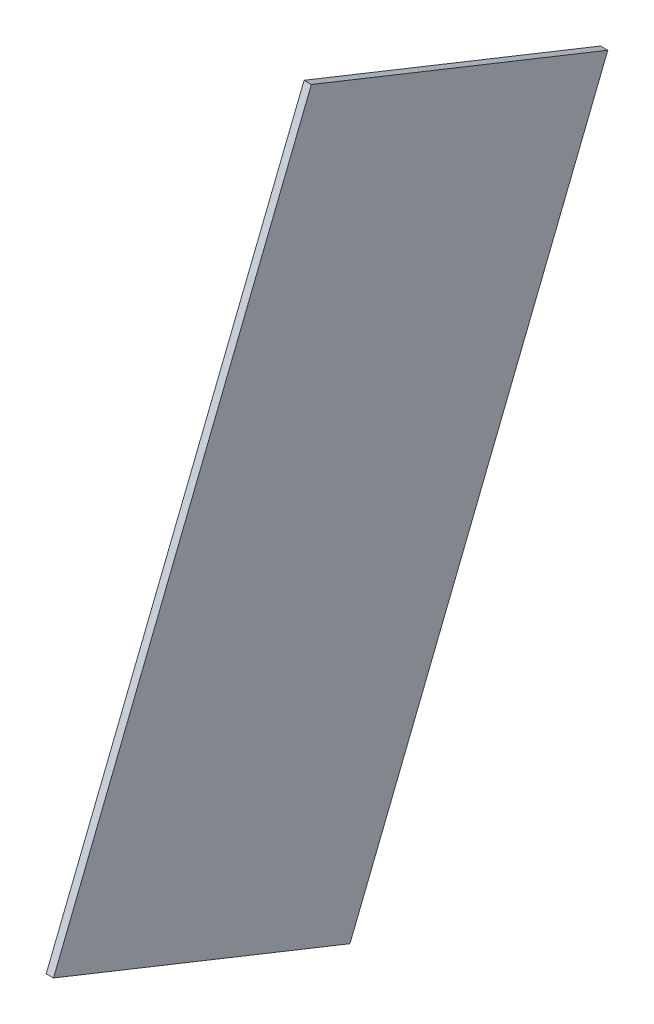
ISO-10303-21;
HEADER;
FILE_DESCRIPTION(('STEP AP214'),'2;1');
FILE_NAME('part.step','',(''),(''),'','','');
FILE_SCHEMA(('AUTOMOTIVE_DESIGN { 1 0 10303 214 1 1 1 1 }'));
ENDSEC;
DATA;
#1=APPLICATION_CONTEXT('core data for automotive mechanical design processes');
#2=APPLICATION_PROTOCOL_DEFINITION('international standard','automotive_design',2000,#1);
#3=PRODUCT_CONTEXT('',#1,'mechanical');
#4=PRODUCT('Part','Part','',(#3));
#5=PRODUCT_RELATED_PRODUCT_CATEGORY('part','',(#4));
#6=PRODUCT_DEFINITION_FORMATION('','',#4);
#7=PRODUCT_DEFINITION_CONTEXT('part definition',#1,'design');
#8=PRODUCT_DEFINITION('design','',#6,#7);
#9=PRODUCT_DEFINITION_SHAPE('','',#8);
#10=(LENGTH_UNIT() NAMED_UNIT(*) SI_UNIT(.MILLI.,.METRE.));
#11=(NAMED_UNIT(*) PLANE_ANGLE_UNIT() SI_UNIT($,.RADIAN.));
#12=(NAMED_UNIT(*) SI_UNIT($,.STERADIAN.) SOLID_ANGLE_UNIT());
#13=UNCERTAINTY_MEASURE_WITH_UNIT(LENGTH_MEASURE(1.E-05),#10,'distance_accuracy_value','');
#14=(GEOMETRIC_REPRESENTATION_CONTEXT(3) GLOBAL_UNCERTAINTY_ASSIGNED_CONTEXT((#13)) GLOBAL_UNIT_ASSIGNED_CONTEXT((#10,
#11,#12)) REPRESENTATION_CONTEXT('',''));
#15=CARTESIAN_POINT('',(0.,0.,0.));
#16=DIRECTION('',(0.,0.,1.));
#17=DIRECTION('',(1.,0.,0.));
#18=AXIS2_PLACEMENT_3D('',#15,#16,#17);
#19=CARTESIAN_POINT('',(0.835351593057334,-1012.80899751434,-1561.26799174818));
#20=DIRECTION('',(1.,0.,0.));
#21=DIRECTION('',(0.,1.,0.));
#22=AXIS2_PLACEMENT_3D('',#19,#20,#21);
#23=PLANE('',#22);
#24=DIRECTION('',(0.,-0.371270426393831,-0.928524781836943));
#25=VECTOR('',#24,1.);
#26=CARTESIAN_POINT('',(0.835351593057223,-891.14035938506,-1609.91716949834));
#27=LINE('',#26,#25);
#28=CARTESIAN_POINT('',(0.835351593056808,-842.503933527468,-1488.2804230777));
#29=VERTEX_POINT('',#28);
#30=CARTESIAN_POINT('',(0.835351593057223,-891.14035938506,-1609.91716949834));
#31=VERTEX_POINT('',#30);
#32=EDGE_CURVE('E83',#29,#31,#27,.T.);
#33=ORIENTED_EDGE('',*,*,#32,.F.);
#34=DIRECTION('',(0.,0.928524781836943,-0.371270426393831));
#35=VECTOR('',#34,1.);
#36=CARTESIAN_POINT('',(0.835351593057161,-964.172571656747,-1439.63124532754));
#37=LINE('',#36,#35);
#38=CARTESIAN_POINT('',(0.835351593056808,-577.874370703939,-1594.09249459994));
#39=VERTEX_POINT('',#38);
#40=EDGE_CURVE('E37',#29,#39,#37,.T.);
#41=ORIENTED_EDGE('',*,*,#40,.T.);
#42=DIRECTION('',(0.,-0.371270426393832,-0.928524781836943));
#43=VECTOR('',#42,1.);
#44=CARTESIAN_POINT('',(0.835351593056981,-626.510796561531,-1715.72924102059));
#45=LINE('',#44,#43);
#46=CARTESIAN_POINT('',(0.835351593056981,-626.510796561531,-1715.72924102059));
#47=VERTEX_POINT('',#46);
#48=EDGE_CURVE('E81',#39,#47,#45,.T.);
#49=ORIENTED_EDGE('',*,*,#48,.T.);
#50=DIRECTION('',(0.,0.928524781836943,-0.371270426393831));
#51=VECTOR('',#50,1.);
#52=CARTESIAN_POINT('',(0.835351593057334,-1012.80899751434,-1561.26799174818));
#53=LINE('',#52,#51);
#54=EDGE_CURVE('E72',#31,#47,#53,.T.);
#55=ORIENTED_EDGE('',*,*,#54,.F.);
#56=EDGE_LOOP('',(#33,#41,#49,#55));
#57=FACE_BOUND('',#56,.T.);
#58=ADVANCED_FACE('F33',(#57),#23,.F.);
#59=CARTESIAN_POINT('',(0.835351593057334,-1012.80899751434,-1561.26799174818));
#60=DIRECTION('',(0.,0.371270426393831,0.928524781836943));
#61=DIRECTION('',(0.,-0.928524781836943,0.371270426393831));
#62=AXIS2_PLACEMENT_3D('',#59,#60,#61);
#63=PLANE('',#62);
#64=DIRECTION('',(1.,0.,0.));
#65=VECTOR('',#64,1.);
#66=CARTESIAN_POINT('',(0.835351593057223,-891.14035938506,-1609.91716949834));
#67=LINE('',#66,#65);
#68=CARTESIAN_POINT('',(3.83535159305722,-891.14035938506,-1609.91716949834));
#69=VERTEX_POINT('',#68);
#70=EDGE_CURVE('E42',#31,#69,#67,.T.);
#71=ORIENTED_EDGE('',*,*,#70,.F.);
#72=ORIENTED_EDGE('',*,*,#54,.T.);
#73=DIRECTION('',(1.,0.,0.));
#74=VECTOR('',#73,1.);
#75=CARTESIAN_POINT('',(0.835351593056981,-626.510796561531,-1715.72924102059));
#76=LINE('',#75,#74);
#77=CARTESIAN_POINT('',(3.83535159305698,-626.510796561531,-1715.72924102059));
#78=VERTEX_POINT('',#77);
#79=EDGE_CURVE('E93',#47,#78,#76,.T.);
#80=ORIENTED_EDGE('',*,*,#79,.T.);
#81=DIRECTION('',(0.,0.928524781836943,-0.371270426393831));
#82=VECTOR('',#81,1.);
#83=CARTESIAN_POINT('',(3.83535159305733,-1012.80899751434,-1561.26799174818));
#84=LINE('',#83,#82);
#85=EDGE_CURVE('E102',#69,#78,#84,.T.);
#86=ORIENTED_EDGE('',*,*,#85,.F.);
#87=EDGE_LOOP('',(#71,#72,#80,#86));
#88=FACE_BOUND('',#87,.T.);
#89=ADVANCED_FACE('F106',(#88),#63,.F.);
#90=CARTESIAN_POINT('',(3.83535159305718,-964.172571656747,-1439.63124532754));
#91=DIRECTION('',(-1.,0.,0.));
#92=DIRECTION('',(0.,-1.,0.));
#93=AXIS2_PLACEMENT_3D('',#90,#91,#92);
#94=PLANE('',#93);
#95=DIRECTION('',(0.,0.371270426393831,0.928524781836943));
#96=VECTOR('',#95,1.);
#97=CARTESIAN_POINT('',(3.83535159305707,-842.503933527468,-1488.2804230777));
#98=LINE('',#97,#96);
#99=CARTESIAN_POINT('',(3.83535159305707,-842.503933527468,-1488.2804230777));
#100=VERTEX_POINT('',#99);
#101=EDGE_CURVE('E11',#69,#100,#98,.T.);
#102=ORIENTED_EDGE('',*,*,#101,.F.);
#103=ORIENTED_EDGE('',*,*,#85,.T.);
#104=DIRECTION('',(0.,0.371270426393832,0.928524781836943));
#105=VECTOR('',#104,1.);
#106=CARTESIAN_POINT('',(3.83535159305682,-577.874370703939,-1594.09249459994));
#107=LINE('',#106,#105);
#108=CARTESIAN_POINT('',(3.83535159305682,-577.874370703939,-1594.09249459994));
#109=VERTEX_POINT('',#108);
#110=EDGE_CURVE('E103',#78,#109,#107,.T.);
#111=ORIENTED_EDGE('',*,*,#110,.T.);
#112=DIRECTION('',(0.,0.928524781836943,-0.371270426393831));
#113=VECTOR('',#112,1.);
#114=CARTESIAN_POINT('',(3.83535159305718,-964.172571656747,-1439.63124532754));
#115=LINE('',#114,#113);
#116=EDGE_CURVE('E55',#100,#109,#115,.T.);
#117=ORIENTED_EDGE('',*,*,#116,.F.);
#118=EDGE_LOOP('',(#102,#103,#111,#117));
#119=FACE_BOUND('',#118,.T.);
#120=ADVANCED_FACE('F105',(#119),#94,.F.);
#121=CARTESIAN_POINT('',(0.835351593057161,-964.172571656747,-1439.63124532754));
#122=DIRECTION('',(0.,-0.371270426393831,-0.928524781836943));
#123=DIRECTION('',(0.,0.928524781836943,-0.371270426393831));
#124=AXIS2_PLACEMENT_3D('',#121,#122,#123);
#125=PLANE('',#124);
#126=DIRECTION('',(-1.,0.,0.));
#127=VECTOR('',#126,1.);
#128=CARTESIAN_POINT('',(0.83535159305705,-842.503933527468,-1488.2804230777));
#129=LINE('',#128,#127);
#130=EDGE_CURVE('E90',#100,#29,#129,.T.);
#131=ORIENTED_EDGE('',*,*,#130,.F.);
#132=ORIENTED_EDGE('',*,*,#116,.T.);
#133=DIRECTION('',(-1.,0.,0.));
#134=VECTOR('',#133,1.);
#135=CARTESIAN_POINT('',(0.835351593056808,-577.874370703939,-1594.09249459994));
#136=LINE('',#135,#134);
#137=EDGE_CURVE('E86',#109,#39,#136,.T.);
#138=ORIENTED_EDGE('',*,*,#137,.T.);
#139=ORIENTED_EDGE('',*,*,#40,.F.);
#140=EDGE_LOOP('',(#131,#132,#138,#139));
#141=FACE_BOUND('',#140,.T.);
#142=ADVANCED_FACE('F87',(#141),#125,.F.);
#143=CARTESIAN_POINT('',(0.,51.3183819319617,-20.5196435403991));
#144=DIRECTION('',(0.,0.928524781836943,-0.371270426393832));
#145=DIRECTION('',(0.,0.371270426393832,0.928524781836943));
#146=AXIS2_PLACEMENT_3D('',#143,#144,#145);
#147=PLANE('',#146);
#148=ORIENTED_EDGE('',*,*,#48,.F.);
#149=ORIENTED_EDGE('',*,*,#137,.F.);
#150=ORIENTED_EDGE('',*,*,#110,.F.);
#151=ORIENTED_EDGE('',*,*,#79,.F.);
#152=EDGE_LOOP('',(#148,#149,#150,#151));
#153=FACE_BOUND('',#152,.T.);
#154=ADVANCED_FACE('F92',(#153),#147,.T.);
#155=CARTESIAN_POINT('',(46.3353515930569,-939.962420455849,-1732.0181783099));
#156=DIRECTION('',(0.,-0.928524781836943,0.371270426393831));
#157=DIRECTION('',(-1.,0.,0.));
#158=AXIS2_PLACEMENT_3D('',#155,#156,#157);
#159=PLANE('',#158);
#160=ORIENTED_EDGE('',*,*,#130,.T.);
#161=ORIENTED_EDGE('',*,*,#32,.T.);
#162=ORIENTED_EDGE('',*,*,#70,.T.);
#163=ORIENTED_EDGE('',*,*,#101,.T.);
#164=EDGE_LOOP('',(#160,#161,#162,#163));
#165=FACE_BOUND('',#164,.T.);
#166=ADVANCED_FACE('F35',(#165),#159,.T.);
#167=CLOSED_SHELL('',(#58,#89,#120,#142,#154,#166));
#168=MANIFOLD_SOLID_BREP('B2',#167);
#169=ADVANCED_BREP_SHAPE_REPRESENTATION('',(#18,#168),#14);
#170=SHAPE_DEFINITION_REPRESENTATION(#9,#169);
ENDSEC;
END-ISO-10303-21;
